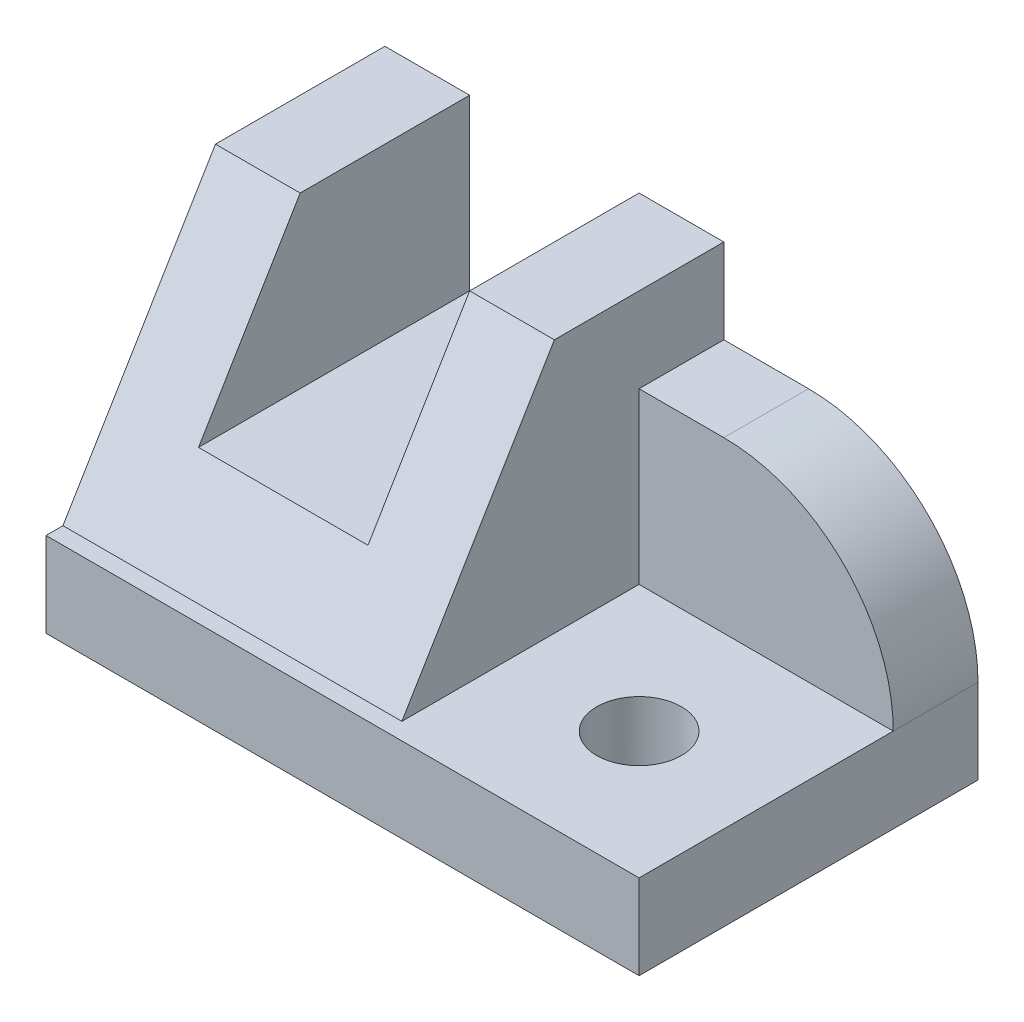
ISO-10303-21;
HEADER;
FILE_DESCRIPTION(('STEP AP214'),'2;1');
FILE_NAME('part.step','',(''),(''),'','','');
FILE_SCHEMA(('AUTOMOTIVE_DESIGN { 1 0 10303 214 1 1 1 1 }'));
ENDSEC;
DATA;
#1=APPLICATION_CONTEXT('core data for automotive mechanical design processes');
#2=APPLICATION_PROTOCOL_DEFINITION('international standard','automotive_design',2000,#1);
#3=PRODUCT_CONTEXT('',#1,'mechanical');
#4=PRODUCT('Part','Part','',(#3));
#5=PRODUCT_RELATED_PRODUCT_CATEGORY('part','',(#4));
#6=PRODUCT_DEFINITION_FORMATION('','',#4);
#7=PRODUCT_DEFINITION_CONTEXT('part definition',#1,'design');
#8=PRODUCT_DEFINITION('design','',#6,#7);
#9=PRODUCT_DEFINITION_SHAPE('','',#8);
#10=(LENGTH_UNIT() NAMED_UNIT(*) SI_UNIT(.MILLI.,.METRE.));
#11=(NAMED_UNIT(*) PLANE_ANGLE_UNIT() SI_UNIT($,.RADIAN.));
#12=(NAMED_UNIT(*) SI_UNIT($,.STERADIAN.) SOLID_ANGLE_UNIT());
#13=UNCERTAINTY_MEASURE_WITH_UNIT(LENGTH_MEASURE(1.E-05),#10,'distance_accuracy_value','');
#14=(GEOMETRIC_REPRESENTATION_CONTEXT(3) GLOBAL_UNCERTAINTY_ASSIGNED_CONTEXT((#13)) GLOBAL_UNIT_ASSIGNED_CONTEXT((#10,
#11,#12)) REPRESENTATION_CONTEXT('',''));
#15=CARTESIAN_POINT('',(0.,0.,0.));
#16=DIRECTION('',(0.,0.,1.));
#17=DIRECTION('',(1.,0.,0.));
#18=AXIS2_PLACEMENT_3D('',#15,#16,#17);
#19=CARTESIAN_POINT('',(40.,40.,-40.));
#20=DIRECTION('',(0.,-1.,0.));
#21=DIRECTION('',(0.,0.,-1.));
#22=AXIS2_PLACEMENT_3D('',#19,#20,#21);
#23=PLANE('',#22);
#24=DIRECTION('',(-1.,0.,0.));
#25=VECTOR('',#24,1.);
#26=CARTESIAN_POINT('',(40.,40.,-20.));
#27=LINE('',#26,#25);
#28=CARTESIAN_POINT('',(9.99999999999998,40.,-20.));
#29=VERTEX_POINT('',#28);
#30=CARTESIAN_POINT('',(0.,40.,-20.));
#31=VERTEX_POINT('',#30);
#32=EDGE_CURVE('E235',#29,#31,#27,.T.);
#33=ORIENTED_EDGE('',*,*,#32,.F.);
#34=DIRECTION('',(0.,0.,-1.));
#35=VECTOR('',#34,1.);
#36=CARTESIAN_POINT('',(9.99999999999998,40.,0.));
#37=LINE('',#36,#35);
#38=CARTESIAN_POINT('',(9.99999999999999,40.,-40.));
#39=VERTEX_POINT('',#38);
#40=EDGE_CURVE('E160',#29,#39,#37,.T.);
#41=ORIENTED_EDGE('',*,*,#40,.T.);
#42=DIRECTION('',(1.,0.,0.));
#43=VECTOR('',#42,1.);
#44=CARTESIAN_POINT('',(40.,40.,-40.));
#45=LINE('',#44,#43);
#46=CARTESIAN_POINT('',(0.,40.,-40.));
#47=VERTEX_POINT('',#46);
#48=EDGE_CURVE('E219',#47,#39,#45,.T.);
#49=ORIENTED_EDGE('',*,*,#48,.F.);
#50=DIRECTION('',(0.,0.,1.));
#51=VECTOR('',#50,1.);
#52=CARTESIAN_POINT('',(0.,40.,-40.));
#53=LINE('',#52,#51);
#54=EDGE_CURVE('E221',#47,#31,#53,.T.);
#55=ORIENTED_EDGE('',*,*,#54,.T.);
#56=EDGE_LOOP('',(#33,#41,#49,#55));
#57=FACE_BOUND('',#56,.T.);
#58=ADVANCED_FACE('F35',(#57),#23,.F.);
#59=CARTESIAN_POINT('',(40.,10.,-2.00000000000001));
#60=DIRECTION('',(0.,0.514495755427527,0.857492925712544));
#61=DIRECTION('',(0.,-0.857492925712544,0.514495755427527));
#62=AXIS2_PLACEMENT_3D('',#59,#60,#61);
#63=PLANE('',#62);
#64=DIRECTION('',(0.,-0.857492925712544,0.514495755427527));
#65=VECTOR('',#64,1.);
#66=CARTESIAN_POINT('',(9.99999999999998,10.,-2.00000000000001));
#67=LINE('',#66,#65);
#68=CARTESIAN_POINT('',(9.99999999999998,20.,-8.));
#69=VERTEX_POINT('',#68);
#70=EDGE_CURVE('E168',#29,#69,#67,.T.);
#71=ORIENTED_EDGE('',*,*,#70,.F.);
#72=ORIENTED_EDGE('',*,*,#32,.T.);
#73=DIRECTION('',(0.,0.857492925712544,-0.514495755427527));
#74=VECTOR('',#73,1.);
#75=CARTESIAN_POINT('',(0.,10.,-2.00000000000001));
#76=LINE('',#75,#74);
#77=CARTESIAN_POINT('',(0.,10.,-2.00000000000002));
#78=VERTEX_POINT('',#77);
#79=EDGE_CURVE('E224',#78,#31,#76,.T.);
#80=ORIENTED_EDGE('',*,*,#79,.F.);
#81=DIRECTION('',(-1.,0.,0.));
#82=VECTOR('',#81,1.);
#83=CARTESIAN_POINT('',(40.,10.,-2.00000000000001));
#84=LINE('',#83,#82);
#85=CARTESIAN_POINT('',(40.,10.,-2.00000000000001));
#86=VERTEX_POINT('',#85);
#87=EDGE_CURVE('E228',#86,#78,#84,.T.);
#88=ORIENTED_EDGE('',*,*,#87,.F.);
#89=DIRECTION('',(0.,0.857492925712544,-0.514495755427527));
#90=VECTOR('',#89,1.);
#91=CARTESIAN_POINT('',(40.,10.,-2.00000000000001));
#92=LINE('',#91,#90);
#93=CARTESIAN_POINT('',(40.,40.,-20.));
#94=VERTEX_POINT('',#93);
#95=EDGE_CURVE('E225',#86,#94,#92,.T.);
#96=ORIENTED_EDGE('',*,*,#95,.T.);
#97=CARTESIAN_POINT('',(30.,40.,-20.));
#98=VERTEX_POINT('',#97);
#99=EDGE_CURVE('E231',#94,#98,#27,.T.);
#100=ORIENTED_EDGE('',*,*,#99,.T.);
#101=DIRECTION('',(0.,0.857492925712544,-0.514495755427527));
#102=VECTOR('',#101,1.);
#103=CARTESIAN_POINT('',(30.,10.,-2.00000000000001));
#104=LINE('',#103,#102);
#105=CARTESIAN_POINT('',(30.,20.,-8.00000000000001));
#106=VERTEX_POINT('',#105);
#107=EDGE_CURVE('E163',#106,#98,#104,.T.);
#108=ORIENTED_EDGE('',*,*,#107,.F.);
#109=DIRECTION('',(1.,0.,0.));
#110=VECTOR('',#109,1.);
#111=CARTESIAN_POINT('',(40.,20.,-8.));
#112=LINE('',#111,#110);
#113=EDGE_CURVE('E140',#69,#106,#112,.T.);
#114=ORIENTED_EDGE('',*,*,#113,.F.);
#115=EDGE_LOOP('',(#71,#72,#80,#88,#96,#100,#108,#114));
#116=FACE_BOUND('',#115,.T.);
#117=ADVANCED_FACE('F270',(#116),#63,.T.);
#118=CARTESIAN_POINT('',(0.,0.,0.));
#119=DIRECTION('',(1.,0.,0.));
#120=DIRECTION('',(0.,0.,-1.));
#121=AXIS2_PLACEMENT_3D('',#118,#119,#120);
#122=PLANE('',#121);
#123=DIRECTION('',(0.,1.,0.));
#124=VECTOR('',#123,1.);
#125=CARTESIAN_POINT('',(0.,40.,-40.));
#126=LINE('',#125,#124);
#127=CARTESIAN_POINT('',(0.,0.,-40.));
#128=VERTEX_POINT('',#127);
#129=EDGE_CURVE('E216',#128,#47,#126,.T.);
#130=ORIENTED_EDGE('',*,*,#129,.F.);
#131=DIRECTION('',(0.,0.,-1.));
#132=VECTOR('',#131,1.);
#133=CARTESIAN_POINT('',(0.,0.,-40.));
#134=LINE('',#133,#132);
#135=CARTESIAN_POINT('',(0.,0.,0.));
#136=VERTEX_POINT('',#135);
#137=EDGE_CURVE('E174',#136,#128,#134,.T.);
#138=ORIENTED_EDGE('',*,*,#137,.F.);
#139=DIRECTION('',(0.,1.,0.));
#140=VECTOR('',#139,1.);
#141=CARTESIAN_POINT('',(0.,0.,0.));
#142=LINE('',#141,#140);
#143=CARTESIAN_POINT('',(0.,10.,0.));
#144=VERTEX_POINT('',#143);
#145=EDGE_CURVE('E192',#136,#144,#142,.T.);
#146=ORIENTED_EDGE('',*,*,#145,.T.);
#147=DIRECTION('',(0.,0.,-1.));
#148=VECTOR('',#147,1.);
#149=CARTESIAN_POINT('',(0.,10.,-40.));
#150=LINE('',#149,#148);
#151=EDGE_CURVE('E186',#144,#78,#150,.T.);
#152=ORIENTED_EDGE('',*,*,#151,.T.);
#153=ORIENTED_EDGE('',*,*,#79,.T.);
#154=ORIENTED_EDGE('',*,*,#54,.F.);
#155=EDGE_LOOP('',(#130,#138,#146,#152,#153,#154));
#156=FACE_BOUND('',#155,.T.);
#157=ADVANCED_FACE('F273',(#156),#122,.F.);
#158=CARTESIAN_POINT('',(30.,40.,-40.));
#159=VERTEX_POINT('',#158);
#160=CARTESIAN_POINT('',(40.,40.,-40.));
#161=VERTEX_POINT('',#160);
#162=EDGE_CURVE('E218',#159,#161,#45,.T.);
#163=ORIENTED_EDGE('',*,*,#162,.F.);
#164=DIRECTION('',(0.,0.,-1.));
#165=VECTOR('',#164,1.);
#166=CARTESIAN_POINT('',(30.,40.,0.));
#167=LINE('',#166,#165);
#168=EDGE_CURVE('E144',#98,#159,#167,.T.);
#169=ORIENTED_EDGE('',*,*,#168,.F.);
#170=ORIENTED_EDGE('',*,*,#99,.F.);
#171=DIRECTION('',(0.,0.,1.));
#172=VECTOR('',#171,1.);
#173=CARTESIAN_POINT('',(40.,40.,-40.));
#174=LINE('',#173,#172);
#175=EDGE_CURVE('E195',#161,#94,#174,.T.);
#176=ORIENTED_EDGE('',*,*,#175,.F.);
#177=EDGE_LOOP('',(#163,#169,#170,#176));
#178=FACE_BOUND('',#177,.T.);
#179=ADVANCED_FACE('F267',(#178),#23,.F.);
#180=CARTESIAN_POINT('',(0.,0.,-40.));
#181=DIRECTION('',(0.,0.,1.));
#182=DIRECTION('',(0.,-1.,0.));
#183=AXIS2_PLACEMENT_3D('',#180,#181,#182);
#184=PLANE('',#183);
#185=DIRECTION('',(1.,0.,0.));
#186=VECTOR('',#185,1.);
#187=CARTESIAN_POINT('',(40.,30.,-40.));
#188=LINE('',#187,#186);
#189=CARTESIAN_POINT('',(40.,30.,-40.));
#190=VERTEX_POINT('',#189);
#191=CARTESIAN_POINT('',(50.,30.,-40.));
#192=VERTEX_POINT('',#191);
#193=EDGE_CURVE('E209',#190,#192,#188,.T.);
#194=ORIENTED_EDGE('',*,*,#193,.T.);
#195=CARTESIAN_POINT('',(50.,9.99999999999999,-40.));
#196=DIRECTION('',(0.,0.,1.));
#197=DIRECTION('',(0.,-1.,0.));
#198=AXIS2_PLACEMENT_3D('',#195,#196,#197);
#199=CIRCLE('',#198,20.);
#200=CARTESIAN_POINT('',(70.,10.,-40.));
#201=VERTEX_POINT('',#200);
#202=EDGE_CURVE('E50',#192,#201,#199,.F.);
#203=ORIENTED_EDGE('',*,*,#202,.T.);
#204=DIRECTION('',(0.,1.,0.));
#205=VECTOR('',#204,1.);
#206=CARTESIAN_POINT('',(70.,40.,-40.));
#207=LINE('',#206,#205);
#208=CARTESIAN_POINT('',(70.,0.,-40.));
#209=VERTEX_POINT('',#208);
#210=EDGE_CURVE('E211',#209,#201,#207,.T.);
#211=ORIENTED_EDGE('',*,*,#210,.F.);
#212=DIRECTION('',(1.,0.,0.));
#213=VECTOR('',#212,1.);
#214=CARTESIAN_POINT('',(70.,0.,-40.));
#215=LINE('',#214,#213);
#216=EDGE_CURVE('E178',#128,#209,#215,.T.);
#217=ORIENTED_EDGE('',*,*,#216,.F.);
#218=ORIENTED_EDGE('',*,*,#129,.T.);
#219=ORIENTED_EDGE('',*,*,#48,.T.);
#220=DIRECTION('',(0.,1.,0.));
#221=VECTOR('',#220,1.);
#222=CARTESIAN_POINT('',(9.99999999999999,20.,-40.));
#223=LINE('',#222,#221);
#224=CARTESIAN_POINT('',(9.99999999999999,20.,-40.));
#225=VERTEX_POINT('',#224);
#226=EDGE_CURVE('E155',#225,#39,#223,.T.);
#227=ORIENTED_EDGE('',*,*,#226,.F.);
#228=DIRECTION('',(-1.,0.,0.));
#229=VECTOR('',#228,1.);
#230=CARTESIAN_POINT('',(30.,20.,-40.));
#231=LINE('',#230,#229);
#232=CARTESIAN_POINT('',(30.,20.,-40.));
#233=VERTEX_POINT('',#232);
#234=EDGE_CURVE('E137',#233,#225,#231,.T.);
#235=ORIENTED_EDGE('',*,*,#234,.F.);
#236=DIRECTION('',(0.,-1.,0.));
#237=VECTOR('',#236,1.);
#238=CARTESIAN_POINT('',(30.,40.,-40.));
#239=LINE('',#238,#237);
#240=EDGE_CURVE('E147',#159,#233,#239,.T.);
#241=ORIENTED_EDGE('',*,*,#240,.F.);
#242=ORIENTED_EDGE('',*,*,#162,.T.);
#243=DIRECTION('',(0.,1.,0.));
#244=VECTOR('',#243,1.);
#245=CARTESIAN_POINT('',(40.,30.,-40.));
#246=LINE('',#245,#244);
#247=EDGE_CURVE('E205',#190,#161,#246,.T.);
#248=ORIENTED_EDGE('',*,*,#247,.F.);
#249=EDGE_LOOP('',(#194,#203,#211,#217,#218,#219,#227,#235,#241,#242,#248));
#250=FACE_BOUND('',#249,.T.);
#251=ADVANCED_FACE('F153',(#250),#184,.F.);
#252=CARTESIAN_POINT('',(70.,0.,0.));
#253=DIRECTION('',(-1.,0.,0.));
#254=DIRECTION('',(0.,0.,1.));
#255=AXIS2_PLACEMENT_3D('',#252,#253,#254);
#256=PLANE('',#255);
#257=ORIENTED_EDGE('',*,*,#210,.T.);
#258=DIRECTION('',(0.,0.,-1.));
#259=VECTOR('',#258,1.);
#260=CARTESIAN_POINT('',(70.,9.99999999999999,0.));
#261=LINE('',#260,#259);
#262=CARTESIAN_POINT('',(70.,10.,-30.));
#263=VERTEX_POINT('',#262);
#264=EDGE_CURVE('E43',#201,#263,#261,.F.);
#265=ORIENTED_EDGE('',*,*,#264,.T.);
#266=DIRECTION('',(0.,0.,1.));
#267=VECTOR('',#266,1.);
#268=CARTESIAN_POINT('',(70.,10.,0.));
#269=LINE('',#268,#267);
#270=CARTESIAN_POINT('',(70.,10.,0.));
#271=VERTEX_POINT('',#270);
#272=EDGE_CURVE('E175',#263,#271,#269,.T.);
#273=ORIENTED_EDGE('',*,*,#272,.T.);
#274=DIRECTION('',(0.,1.,0.));
#275=VECTOR('',#274,1.);
#276=CARTESIAN_POINT('',(70.,0.,0.));
#277=LINE('',#276,#275);
#278=CARTESIAN_POINT('',(70.,0.,0.));
#279=VERTEX_POINT('',#278);
#280=EDGE_CURVE('E183',#279,#271,#277,.T.);
#281=ORIENTED_EDGE('',*,*,#280,.F.);
#282=DIRECTION('',(0.,0.,1.));
#283=VECTOR('',#282,1.);
#284=CARTESIAN_POINT('',(70.,0.,0.));
#285=LINE('',#284,#283);
#286=EDGE_CURVE('E181',#209,#279,#285,.T.);
#287=ORIENTED_EDGE('',*,*,#286,.F.);
#288=EDGE_LOOP('',(#257,#265,#273,#281,#287));
#289=FACE_BOUND('',#288,.T.);
#290=ADVANCED_FACE('F245',(#289),#256,.F.);
#291=CARTESIAN_POINT('',(40.,30.,-30.));
#292=DIRECTION('',(0.,-1.,0.));
#293=DIRECTION('',(0.,0.,-1.));
#294=AXIS2_PLACEMENT_3D('',#291,#292,#293);
#295=PLANE('',#294);
#296=DIRECTION('',(1.,0.,0.));
#297=VECTOR('',#296,1.);
#298=CARTESIAN_POINT('',(40.,30.,-30.));
#299=LINE('',#298,#297);
#300=CARTESIAN_POINT('',(40.,30.,-30.));
#301=VERTEX_POINT('',#300);
#302=CARTESIAN_POINT('',(50.,30.,-30.));
#303=VERTEX_POINT('',#302);
#304=EDGE_CURVE('E212',#301,#303,#299,.T.);
#305=ORIENTED_EDGE('',*,*,#304,.T.);
#306=DIRECTION('',(0.,0.,-1.));
#307=VECTOR('',#306,1.);
#308=CARTESIAN_POINT('',(50.,30.,-30.));
#309=LINE('',#308,#307);
#310=EDGE_CURVE('E234',#303,#192,#309,.T.);
#311=ORIENTED_EDGE('',*,*,#310,.T.);
#312=ORIENTED_EDGE('',*,*,#193,.F.);
#313=DIRECTION('',(0.,0.,-1.));
#314=VECTOR('',#313,1.);
#315=CARTESIAN_POINT('',(40.,30.,-30.));
#316=LINE('',#315,#314);
#317=EDGE_CURVE('E202',#301,#190,#316,.T.);
#318=ORIENTED_EDGE('',*,*,#317,.F.);
#319=EDGE_LOOP('',(#305,#311,#312,#318));
#320=FACE_BOUND('',#319,.T.);
#321=ADVANCED_FACE('F259',(#320),#295,.F.);
#322=CARTESIAN_POINT('',(40.,10.,-30.));
#323=DIRECTION('',(0.,0.,-1.));
#324=DIRECTION('',(-1.,0.,0.));
#325=AXIS2_PLACEMENT_3D('',#322,#323,#324);
#326=PLANE('',#325);
#327=DIRECTION('',(1.,0.,0.));
#328=VECTOR('',#327,1.);
#329=CARTESIAN_POINT('',(40.,10.,-30.));
#330=LINE('',#329,#328);
#331=CARTESIAN_POINT('',(40.,10.,-30.));
#332=VERTEX_POINT('',#331);
#333=EDGE_CURVE('E208',#332,#263,#330,.T.);
#334=ORIENTED_EDGE('',*,*,#333,.T.);
#335=CARTESIAN_POINT('',(50.,9.99999999999999,-30.));
#336=DIRECTION('',(0.,0.,-1.));
#337=DIRECTION('',(-1.,0.,0.));
#338=AXIS2_PLACEMENT_3D('',#335,#336,#337);
#339=CIRCLE('',#338,20.);
#340=EDGE_CURVE('E11',#263,#303,#339,.F.);
#341=ORIENTED_EDGE('',*,*,#340,.T.);
#342=ORIENTED_EDGE('',*,*,#304,.F.);
#343=DIRECTION('',(0.,1.,0.));
#344=VECTOR('',#343,1.);
#345=CARTESIAN_POINT('',(40.,10.,-30.));
#346=LINE('',#345,#344);
#347=EDGE_CURVE('E199',#332,#301,#346,.T.);
#348=ORIENTED_EDGE('',*,*,#347,.F.);
#349=EDGE_LOOP('',(#334,#341,#342,#348));
#350=FACE_BOUND('',#349,.T.);
#351=ADVANCED_FACE('F252',(#350),#326,.F.);
#352=CARTESIAN_POINT('',(40.,0.,0.));
#353=DIRECTION('',(-1.,0.,0.));
#354=DIRECTION('',(0.,0.,1.));
#355=AXIS2_PLACEMENT_3D('',#352,#353,#354);
#356=PLANE('',#355);
#357=ORIENTED_EDGE('',*,*,#95,.F.);
#358=DIRECTION('',(0.,0.,-1.));
#359=VECTOR('',#358,1.);
#360=CARTESIAN_POINT('',(40.,10.,0.));
#361=LINE('',#360,#359);
#362=EDGE_CURVE('E197',#86,#332,#361,.T.);
#363=ORIENTED_EDGE('',*,*,#362,.T.);
#364=ORIENTED_EDGE('',*,*,#347,.T.);
#365=ORIENTED_EDGE('',*,*,#317,.T.);
#366=ORIENTED_EDGE('',*,*,#247,.T.);
#367=ORIENTED_EDGE('',*,*,#175,.T.);
#368=EDGE_LOOP('',(#357,#363,#364,#365,#366,#367));
#369=FACE_BOUND('',#368,.T.);
#370=ADVANCED_FACE('F264',(#369),#356,.F.);
#371=CARTESIAN_POINT('',(0.,10.,0.));
#372=DIRECTION('',(0.,1.,0.));
#373=DIRECTION('',(0.,0.,1.));
#374=AXIS2_PLACEMENT_3D('',#371,#372,#373);
#375=PLANE('',#374);
#376=CARTESIAN_POINT('',(55.,10.,-15.));
#377=DIRECTION('',(0.,1.,0.));
#378=DIRECTION('',(0.,0.,1.));
#379=AXIS2_PLACEMENT_3D('',#376,#377,#378);
#380=CIRCLE('',#379,4.99999999999998);
#381=CARTESIAN_POINT('',(55.,10.,-10.));
#382=VERTEX_POINT('',#381);
#383=EDGE_CURVE('E151',#382,#382,#380,.T.);
#384=ORIENTED_EDGE('',*,*,#383,.F.);
#385=EDGE_LOOP('',(#384));
#386=FACE_BOUND('',#385,.T.);
#387=ORIENTED_EDGE('',*,*,#333,.F.);
#388=ORIENTED_EDGE('',*,*,#362,.F.);
#389=ORIENTED_EDGE('',*,*,#87,.T.);
#390=ORIENTED_EDGE('',*,*,#151,.F.);
#391=DIRECTION('',(-1.,0.,0.));
#392=VECTOR('',#391,1.);
#393=CARTESIAN_POINT('',(0.,10.,0.));
#394=LINE('',#393,#392);
#395=EDGE_CURVE('E170',#271,#144,#394,.T.);
#396=ORIENTED_EDGE('',*,*,#395,.F.);
#397=ORIENTED_EDGE('',*,*,#272,.F.);
#398=EDGE_LOOP('',(#387,#388,#389,#390,#396,#397));
#399=FACE_BOUND('',#398,.T.);
#400=ADVANCED_FACE('F256',(#386,#399),#375,.T.);
#401=CARTESIAN_POINT('',(0.,0.,0.));
#402=DIRECTION('',(0.,0.,-1.));
#403=DIRECTION('',(-1.,0.,0.));
#404=AXIS2_PLACEMENT_3D('',#401,#402,#403);
#405=PLANE('',#404);
#406=ORIENTED_EDGE('',*,*,#395,.T.);
#407=ORIENTED_EDGE('',*,*,#145,.F.);
#408=DIRECTION('',(-1.,0.,0.));
#409=VECTOR('',#408,1.);
#410=CARTESIAN_POINT('',(0.,0.,0.));
#411=LINE('',#410,#409);
#412=EDGE_CURVE('E171',#279,#136,#411,.T.);
#413=ORIENTED_EDGE('',*,*,#412,.F.);
#414=ORIENTED_EDGE('',*,*,#280,.T.);
#415=EDGE_LOOP('',(#406,#407,#413,#414));
#416=FACE_BOUND('',#415,.T.);
#417=ADVANCED_FACE('F278',(#416),#405,.F.);
#418=CARTESIAN_POINT('',(0.,0.,0.));
#419=DIRECTION('',(0.,1.,0.));
#420=DIRECTION('',(0.,0.,1.));
#421=AXIS2_PLACEMENT_3D('',#418,#419,#420);
#422=PLANE('',#421);
#423=CARTESIAN_POINT('',(55.,0.,-15.));
#424=DIRECTION('',(0.,-1.,0.));
#425=DIRECTION('',(0.,0.,-1.));
#426=AXIS2_PLACEMENT_3D('',#423,#424,#425);
#427=CIRCLE('',#426,4.99999999999998);
#428=CARTESIAN_POINT('',(55.,0.,-20.));
#429=VERTEX_POINT('',#428);
#430=EDGE_CURVE('E240',#429,#429,#427,.T.);
#431=ORIENTED_EDGE('',*,*,#430,.F.);
#432=EDGE_LOOP('',(#431));
#433=FACE_BOUND('',#432,.T.);
#434=ORIENTED_EDGE('',*,*,#412,.T.);
#435=ORIENTED_EDGE('',*,*,#137,.T.);
#436=ORIENTED_EDGE('',*,*,#216,.T.);
#437=ORIENTED_EDGE('',*,*,#286,.T.);
#438=EDGE_LOOP('',(#434,#435,#436,#437));
#439=FACE_BOUND('',#438,.T.);
#440=ADVANCED_FACE('F280',(#433,#439),#422,.F.);
#441=CARTESIAN_POINT('',(9.99999999999998,20.,0.));
#442=DIRECTION('',(-1.,0.,0.));
#443=DIRECTION('',(0.,0.,1.));
#444=AXIS2_PLACEMENT_3D('',#441,#442,#443);
#445=PLANE('',#444);
#446=ORIENTED_EDGE('',*,*,#70,.T.);
#447=DIRECTION('',(0.,0.,-1.));
#448=VECTOR('',#447,1.);
#449=CARTESIAN_POINT('',(9.99999999999998,20.,0.));
#450=LINE('',#449,#448);
#451=EDGE_CURVE('E143',#69,#225,#450,.T.);
#452=ORIENTED_EDGE('',*,*,#451,.T.);
#453=ORIENTED_EDGE('',*,*,#226,.T.);
#454=ORIENTED_EDGE('',*,*,#40,.F.);
#455=EDGE_LOOP('',(#446,#452,#453,#454));
#456=FACE_BOUND('',#455,.T.);
#457=ADVANCED_FACE('F286',(#456),#445,.F.);
#458=CARTESIAN_POINT('',(30.,20.,0.));
#459=DIRECTION('',(0.,-1.,0.));
#460=DIRECTION('',(0.,0.,-1.));
#461=AXIS2_PLACEMENT_3D('',#458,#459,#460);
#462=PLANE('',#461);
#463=ORIENTED_EDGE('',*,*,#113,.T.);
#464=DIRECTION('',(0.,0.,-1.));
#465=VECTOR('',#464,1.);
#466=CARTESIAN_POINT('',(30.,20.,0.));
#467=LINE('',#466,#465);
#468=EDGE_CURVE('E132',#106,#233,#467,.T.);
#469=ORIENTED_EDGE('',*,*,#468,.T.);
#470=ORIENTED_EDGE('',*,*,#234,.T.);
#471=ORIENTED_EDGE('',*,*,#451,.F.);
#472=EDGE_LOOP('',(#463,#469,#470,#471));
#473=FACE_BOUND('',#472,.T.);
#474=ADVANCED_FACE('F134',(#473),#462,.F.);
#475=CARTESIAN_POINT('',(30.,40.,0.));
#476=DIRECTION('',(1.,0.,0.));
#477=DIRECTION('',(0.,0.,-1.));
#478=AXIS2_PLACEMENT_3D('',#475,#476,#477);
#479=PLANE('',#478);
#480=ORIENTED_EDGE('',*,*,#107,.T.);
#481=ORIENTED_EDGE('',*,*,#168,.T.);
#482=ORIENTED_EDGE('',*,*,#240,.T.);
#483=ORIENTED_EDGE('',*,*,#468,.F.);
#484=EDGE_LOOP('',(#480,#481,#482,#483));
#485=FACE_BOUND('',#484,.T.);
#486=ADVANCED_FACE('F148',(#485),#479,.F.);
#487=CARTESIAN_POINT('',(55.,0.,-15.));
#488=DIRECTION('',(0.,-1.,0.));
#489=DIRECTION('',(0.,0.,-1.));
#490=AXIS2_PLACEMENT_3D('',#487,#488,#489);
#491=CYLINDRICAL_SURFACE('',#490,4.99999999999998);
#492=ORIENTED_EDGE('',*,*,#383,.T.);
#493=EDGE_LOOP('',(#492));
#494=FACE_BOUND('',#493,.T.);
#495=ORIENTED_EDGE('',*,*,#430,.T.);
#496=EDGE_LOOP('',(#495));
#497=FACE_BOUND('',#496,.T.);
#498=ADVANCED_FACE('F346',(#494,#497),#491,.F.);
#499=CARTESIAN_POINT('',(50.,9.99999999999999,-30.));
#500=DIRECTION('',(0.,0.,-1.));
#501=DIRECTION('',(-1.,0.,0.));
#502=AXIS2_PLACEMENT_3D('',#499,#500,#501);
#503=CYLINDRICAL_SURFACE('',#502,20.);
#504=ORIENTED_EDGE('',*,*,#340,.F.);
#505=ORIENTED_EDGE('',*,*,#264,.F.);
#506=ORIENTED_EDGE('',*,*,#202,.F.);
#507=ORIENTED_EDGE('',*,*,#310,.F.);
#508=EDGE_LOOP('',(#504,#505,#506,#507));
#509=FACE_BOUND('',#508,.T.);
#510=ADVANCED_FACE('F37',(#509),#503,.T.);
#511=CLOSED_SHELL('',(#58,#117,#157,#179,#251,#290,#321,#351,#370,#400,#417,#440,#457,#474,#486,
#498,#510));
#512=MANIFOLD_SOLID_BREP('B2',#511);
#513=ADVANCED_BREP_SHAPE_REPRESENTATION('',(#18,#512),#14);
#514=SHAPE_DEFINITION_REPRESENTATION(#9,#513);
ENDSEC;
END-ISO-10303-21;
